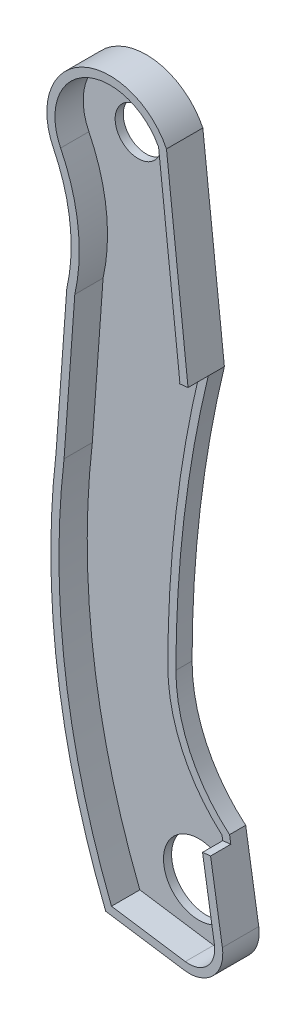
ISO-10303-21;
HEADER;
FILE_DESCRIPTION(('STEP AP214'),'2;1');
FILE_NAME('part.step','',(''),(''),'','','');
FILE_SCHEMA(('AUTOMOTIVE_DESIGN { 1 0 10303 214 1 1 1 1 }'));
ENDSEC;
DATA;
#1=APPLICATION_CONTEXT('core data for automotive mechanical design processes');
#2=APPLICATION_PROTOCOL_DEFINITION('international standard','automotive_design',2000,#1);
#3=PRODUCT_CONTEXT('',#1,'mechanical');
#4=PRODUCT('Part','Part','',(#3));
#5=PRODUCT_RELATED_PRODUCT_CATEGORY('part','',(#4));
#6=PRODUCT_DEFINITION_FORMATION('','',#4);
#7=PRODUCT_DEFINITION_CONTEXT('part definition',#1,'design');
#8=PRODUCT_DEFINITION('design','',#6,#7);
#9=PRODUCT_DEFINITION_SHAPE('','',#8);
#10=(LENGTH_UNIT() NAMED_UNIT(*) SI_UNIT(.MILLI.,.METRE.));
#11=(NAMED_UNIT(*) PLANE_ANGLE_UNIT() SI_UNIT($,.RADIAN.));
#12=(NAMED_UNIT(*) SI_UNIT($,.STERADIAN.) SOLID_ANGLE_UNIT());
#13=UNCERTAINTY_MEASURE_WITH_UNIT(LENGTH_MEASURE(1.E-05),#10,'distance_accuracy_value','');
#14=(GEOMETRIC_REPRESENTATION_CONTEXT(3) GLOBAL_UNCERTAINTY_ASSIGNED_CONTEXT((#13)) GLOBAL_UNIT_ASSIGNED_CONTEXT((#10,
#11,#12)) REPRESENTATION_CONTEXT('',''));
#15=CARTESIAN_POINT('',(0.,0.,0.));
#16=DIRECTION('',(0.,0.,1.));
#17=DIRECTION('',(1.,0.,0.));
#18=AXIS2_PLACEMENT_3D('',#15,#16,#17);
#19=CARTESIAN_POINT('',(57.3609756659918,78.037747086541,3.429));
#20=DIRECTION('',(0.,0.,-1.));
#21=DIRECTION('',(-1.,0.,0.));
#22=AXIS2_PLACEMENT_3D('',#19,#20,#21);
#23=CYLINDRICAL_SURFACE('',#22,5.94359999999999);
#24=CARTESIAN_POINT('',(57.3609756659918,78.037747086541,0.));
#25=DIRECTION('',(0.,0.,1.));
#26=DIRECTION('',(1.,0.,0.));
#27=AXIS2_PLACEMENT_3D('',#24,#25,#26);
#28=CIRCLE('',#27,5.94359999999999);
#29=CARTESIAN_POINT('',(62.6949756659918,80.6597358279356,0.));
#30=VERTEX_POINT('',#29);
#31=CARTESIAN_POINT('',(52.0310096586241,75.4075677541942,0.));
#32=VERTEX_POINT('',#31);
#33=EDGE_CURVE('E315',#30,#32,#28,.T.);
#34=ORIENTED_EDGE('',*,*,#33,.T.);
#35=DIRECTION('',(0.,0.,-1.));
#36=VECTOR('',#35,1.);
#37=CARTESIAN_POINT('',(52.0310096586241,75.4075677541942,3.429));
#38=LINE('',#37,#36);
#39=CARTESIAN_POINT('',(52.0310096586241,75.4075677541942,3.429));
#40=VERTEX_POINT('',#39);
#41=EDGE_CURVE('E254',#40,#32,#38,.T.);
#42=ORIENTED_EDGE('',*,*,#41,.F.);
#43=CARTESIAN_POINT('',(57.3609756659918,78.037747086541,3.429));
#44=DIRECTION('',(0.,0.,1.));
#45=DIRECTION('',(1.,0.,0.));
#46=AXIS2_PLACEMENT_3D('',#43,#44,#45);
#47=CIRCLE('',#46,5.94359999999999);
#48=CARTESIAN_POINT('',(62.6949756659918,80.6597358279356,3.429));
#49=VERTEX_POINT('',#48);
#50=EDGE_CURVE('E323',#49,#40,#47,.T.);
#51=ORIENTED_EDGE('',*,*,#50,.F.);
#52=DIRECTION('',(0.,0.,-1.));
#53=VECTOR('',#52,1.);
#54=CARTESIAN_POINT('',(62.6949756659918,80.6597358279356,3.429));
#55=LINE('',#54,#53);
#56=EDGE_CURVE('E232',#49,#30,#55,.T.);
#57=ORIENTED_EDGE('',*,*,#56,.T.);
#58=EDGE_LOOP('',(#34,#42,#51,#57));
#59=FACE_BOUND('',#58,.T.);
#60=ADVANCED_FACE('F50',(#59),#23,.T.);
#61=CARTESIAN_POINT('',(37.4533248521482,68.2139148793995,3.429));
#62=DIRECTION('',(0.,0.,-1.));
#63=DIRECTION('',(-1.,0.,0.));
#64=AXIS2_PLACEMENT_3D('',#61,#62,#63);
#65=CYLINDRICAL_SURFACE('',#64,16.256);
#66=CARTESIAN_POINT('',(37.4533248521482,68.2139148793995,0.));
#67=DIRECTION('',(0.,0.,-1.));
#68=DIRECTION('',(1.,0.,0.));
#69=AXIS2_PLACEMENT_3D('',#66,#67,#68);
#70=CIRCLE('',#69,16.256);
#71=CARTESIAN_POINT('',(53.2969756659918,64.575747086541,0.));
#72=VERTEX_POINT('',#71);
#73=EDGE_CURVE('E342',#32,#72,#70,.T.);
#74=ORIENTED_EDGE('',*,*,#73,.T.);
#75=DIRECTION('',(0.,0.,-1.));
#76=VECTOR('',#75,1.);
#77=CARTESIAN_POINT('',(53.2969756659918,64.575747086541,3.429));
#78=LINE('',#77,#76);
#79=CARTESIAN_POINT('',(53.2969756659918,64.575747086541,3.429));
#80=VERTEX_POINT('',#79);
#81=EDGE_CURVE('E251',#80,#72,#78,.T.);
#82=ORIENTED_EDGE('',*,*,#81,.F.);
#83=CARTESIAN_POINT('',(37.4533248521482,68.2139148793995,3.429));
#84=DIRECTION('',(0.,0.,-1.));
#85=DIRECTION('',(1.,0.,0.));
#86=AXIS2_PLACEMENT_3D('',#83,#84,#85);
#87=CIRCLE('',#86,16.256);
#88=EDGE_CURVE('E326',#40,#80,#87,.T.);
#89=ORIENTED_EDGE('',*,*,#88,.F.);
#90=ORIENTED_EDGE('',*,*,#41,.T.);
#91=EDGE_LOOP('',(#74,#82,#89,#90));
#92=FACE_BOUND('',#91,.T.);
#93=ADVANCED_FACE('F369',(#92),#65,.F.);
#94=CARTESIAN_POINT('',(53.2969756659918,64.575747086541,3.429));
#95=DIRECTION('',(0.997365816958794,-0.0725356957788216,0.));
#96=DIRECTION('',(0.0725356957788216,0.997365816958794,0.));
#97=AXIS2_PLACEMENT_3D('',#94,#95,#96);
#98=PLANE('',#97);
#99=DIRECTION('',(-0.0725356957788216,-0.997365816958794,0.));
#100=VECTOR('',#99,1.);
#101=CARTESIAN_POINT('',(53.2969756659918,64.575747086541,0.));
#102=LINE('',#101,#100);
#103=CARTESIAN_POINT('',(52.2809756659918,50.605747086541,0.));
#104=VERTEX_POINT('',#103);
#105=EDGE_CURVE('E344',#72,#104,#102,.T.);
#106=ORIENTED_EDGE('',*,*,#105,.T.);
#107=DIRECTION('',(0.,0.,-1.));
#108=VECTOR('',#107,1.);
#109=CARTESIAN_POINT('',(52.2809756659918,50.605747086541,3.429));
#110=LINE('',#109,#108);
#111=CARTESIAN_POINT('',(52.2809756659918,50.605747086541,3.429));
#112=VERTEX_POINT('',#111);
#113=EDGE_CURVE('E248',#112,#104,#110,.T.);
#114=ORIENTED_EDGE('',*,*,#113,.F.);
#115=DIRECTION('',(-0.0725356957788216,-0.997365816958794,0.));
#116=VECTOR('',#115,1.);
#117=CARTESIAN_POINT('',(53.2969756659918,64.575747086541,3.429));
#118=LINE('',#117,#116);
#119=EDGE_CURVE('E329',#80,#112,#118,.T.);
#120=ORIENTED_EDGE('',*,*,#119,.F.);
#121=ORIENTED_EDGE('',*,*,#81,.T.);
#122=EDGE_LOOP('',(#106,#114,#120,#121));
#123=FACE_BOUND('',#122,.T.);
#124=ADVANCED_FACE('F470',(#123),#98,.F.);
#125=CARTESIAN_POINT('',(123.423432401689,42.2798096852975,3.429));
#126=DIRECTION('',(0.,0.,-1.));
#127=DIRECTION('',(-1.,0.,0.));
#128=AXIS2_PLACEMENT_3D('',#125,#126,#127);
#129=CYLINDRICAL_SURFACE('',#128,71.628);
#130=CARTESIAN_POINT('',(123.423432401689,42.2798096852975,0.));
#131=DIRECTION('',(0.,0.,1.));
#132=DIRECTION('',(1.,0.,0.));
#133=AXIS2_PLACEMENT_3D('',#130,#131,#132);
#134=CIRCLE('',#133,71.628);
#135=CARTESIAN_POINT('',(56.9682748744713,15.553747086541,0.));
#136=VERTEX_POINT('',#135);
#137=EDGE_CURVE('E346',#104,#136,#134,.T.);
#138=ORIENTED_EDGE('',*,*,#137,.T.);
#139=DIRECTION('',(0.,0.,-1.));
#140=VECTOR('',#139,1.);
#141=CARTESIAN_POINT('',(56.9682748744713,15.553747086541,3.429));
#142=LINE('',#141,#140);
#143=CARTESIAN_POINT('',(56.9682748744713,15.553747086541,3.429));
#144=VERTEX_POINT('',#143);
#145=EDGE_CURVE('E245',#144,#136,#142,.T.);
#146=ORIENTED_EDGE('',*,*,#145,.F.);
#147=CARTESIAN_POINT('',(123.423432401689,42.2798096852975,3.429));
#148=DIRECTION('',(0.,0.,1.));
#149=DIRECTION('',(1.,0.,0.));
#150=AXIS2_PLACEMENT_3D('',#147,#148,#149);
#151=CIRCLE('',#150,71.628);
#152=EDGE_CURVE('E331',#112,#144,#151,.T.);
#153=ORIENTED_EDGE('',*,*,#152,.F.);
#154=ORIENTED_EDGE('',*,*,#113,.T.);
#155=EDGE_LOOP('',(#138,#146,#153,#154));
#156=FACE_BOUND('',#155,.T.);
#157=ADVANCED_FACE('F468',(#156),#129,.T.);
#158=CARTESIAN_POINT('',(56.9682748744713,15.553747086541,3.429));
#159=DIRECTION('',(0.147671249242656,0.989036501928576,0.));
#160=DIRECTION('',(-0.989036501928576,0.147671249242656,0.));
#161=AXIS2_PLACEMENT_3D('',#158,#159,#160);
#162=PLANE('',#161);
#163=DIRECTION('',(0.989036501928576,-0.147671249242656,0.));
#164=VECTOR('',#163,1.);
#165=CARTESIAN_POINT('',(56.9682748744713,15.553747086541,0.));
#166=LINE('',#165,#164);
#167=CARTESIAN_POINT('',(64.3609255195925,14.4499638046795,0.));
#168=VERTEX_POINT('',#167);
#169=EDGE_CURVE('E348',#136,#168,#166,.T.);
#170=ORIENTED_EDGE('',*,*,#169,.T.);
#171=DIRECTION('',(0.,0.,-1.));
#172=VECTOR('',#171,1.);
#173=CARTESIAN_POINT('',(64.3609255195925,14.4499638046795,3.429));
#174=LINE('',#173,#172);
#175=CARTESIAN_POINT('',(64.3609255195925,14.4499638046795,3.429));
#176=VERTEX_POINT('',#175);
#177=EDGE_CURVE('E262',#168,#176,#174,.F.);
#178=ORIENTED_EDGE('',*,*,#177,.T.);
#179=DIRECTION('',(0.989036501928576,-0.147671249242656,0.));
#180=VECTOR('',#179,1.);
#181=CARTESIAN_POINT('',(56.9682748744713,15.553747086541,3.429));
#182=LINE('',#181,#180);
#183=EDGE_CURVE('E333',#144,#176,#182,.T.);
#184=ORIENTED_EDGE('',*,*,#183,.F.);
#185=ORIENTED_EDGE('',*,*,#145,.T.);
#186=EDGE_LOOP('',(#170,#178,#184,#185));
#187=FACE_BOUND('',#186,.T.);
#188=ADVANCED_FACE('F461',(#187),#162,.F.);
#189=CARTESIAN_POINT('',(66.736169072151,25.7472302029005,3.429));
#190=DIRECTION('',(-0.987362762055992,-0.158476421290872,0.));
#191=DIRECTION('',(0.158476421290872,-0.987362762055992,0.));
#192=AXIS2_PLACEMENT_3D('',#189,#190,#191);
#193=PLANE('',#192);
#194=DIRECTION('',(0.,0.,-1.));
#195=VECTOR('',#194,1.);
#196=CARTESIAN_POINT('',(66.736169072151,25.7472302029005,3.429));
#197=LINE('',#196,#195);
#198=CARTESIAN_POINT('',(66.736169072151,25.7472302029005,1.524));
#199=VERTEX_POINT('',#198);
#200=CARTESIAN_POINT('',(66.736169072151,25.7472302029005,0.));
#201=VERTEX_POINT('',#200);
#202=EDGE_CURVE('E239',#199,#201,#197,.T.);
#203=ORIENTED_EDGE('',*,*,#202,.F.);
#204=DIRECTION('',(0.158476421290872,-0.987362762055992,0.));
#205=VECTOR('',#204,1.);
#206=CARTESIAN_POINT('',(66.736169072151,25.7472302029005,1.52399999999999));
#207=LINE('',#206,#205);
#208=CARTESIAN_POINT('',(66.8532383494613,25.0178482288794,1.52399999999999));
#209=VERTEX_POINT('',#208);
#210=EDGE_CURVE('E383',#199,#209,#207,.T.);
#211=ORIENTED_EDGE('',*,*,#210,.T.);
#212=DIRECTION('',(0.,0.,1.));
#213=VECTOR('',#212,1.);
#214=CARTESIAN_POINT('',(66.8532383494613,25.0178482288794,3.429));
#215=LINE('',#214,#213);
#216=CARTESIAN_POINT('',(66.8532383494613,25.0178482288794,3.429));
#217=VERTEX_POINT('',#216);
#218=EDGE_CURVE('E386',#209,#217,#215,.T.);
#219=ORIENTED_EDGE('',*,*,#218,.T.);
#220=DIRECTION('',(-0.158476421290872,0.987362762055992,0.));
#221=VECTOR('',#220,1.);
#222=CARTESIAN_POINT('',(66.736169072151,25.7472302029005,3.429));
#223=LINE('',#222,#221);
#224=CARTESIAN_POINT('',(67.9646585054657,18.0933173359012,3.429));
#225=VERTEX_POINT('',#224);
#226=EDGE_CURVE('E336',#225,#217,#223,.T.);
#227=ORIENTED_EDGE('',*,*,#226,.F.);
#228=DIRECTION('',(0.,0.,-1.));
#229=VECTOR('',#228,1.);
#230=CARTESIAN_POINT('',(67.9646585054657,18.0933173359012,3.429));
#231=LINE('',#230,#229);
#232=CARTESIAN_POINT('',(67.9646585054657,18.0933173359012,0.));
#233=VERTEX_POINT('',#232);
#234=EDGE_CURVE('E257',#225,#233,#231,.T.);
#235=ORIENTED_EDGE('',*,*,#234,.T.);
#236=DIRECTION('',(-0.158476421290872,0.987362762055992,0.));
#237=VECTOR('',#236,1.);
#238=CARTESIAN_POINT('',(66.736169072151,25.7472302029005,0.));
#239=LINE('',#238,#237);
#240=EDGE_CURVE('E351',#233,#201,#239,.T.);
#241=ORIENTED_EDGE('',*,*,#240,.T.);
#242=EDGE_LOOP('',(#203,#211,#219,#227,#235,#241));
#243=FACE_BOUND('',#242,.T.);
#244=ADVANCED_FACE('F451',(#243),#193,.F.);
#245=CARTESIAN_POINT('',(75.9029703413764,36.6234395834948,3.429));
#246=DIRECTION('',(0.,0.,-1.));
#247=DIRECTION('',(-1.,0.,0.));
#248=AXIS2_PLACEMENT_3D('',#245,#246,#247);
#249=CYLINDRICAL_SURFACE('',#248,14.224);
#250=DIRECTION('',(0.,0.,-1.));
#251=VECTOR('',#250,1.);
#252=CARTESIAN_POINT('',(61.6789756659918,36.6357470865411,3.429));
#253=LINE('',#252,#251);
#254=CARTESIAN_POINT('',(61.6789756659918,36.6357470865411,1.524));
#255=VERTEX_POINT('',#254);
#256=CARTESIAN_POINT('',(61.6789756659918,36.6357470865411,0.));
#257=VERTEX_POINT('',#256);
#258=EDGE_CURVE('E238',#255,#257,#253,.T.);
#259=ORIENTED_EDGE('',*,*,#258,.F.);
#260=CARTESIAN_POINT('',(75.9029703413764,36.6234395834948,1.524));
#261=DIRECTION('',(0.,0.,-1.));
#262=DIRECTION('',(0.,1.,0.));
#263=AXIS2_PLACEMENT_3D('',#260,#261,#262);
#264=CIRCLE('',#263,14.224);
#265=EDGE_CURVE('E209',#255,#199,#264,.F.);
#266=ORIENTED_EDGE('',*,*,#265,.T.);
#267=ORIENTED_EDGE('',*,*,#202,.T.);
#268=CARTESIAN_POINT('',(75.9029703413764,36.6234395834948,0.));
#269=DIRECTION('',(0.,0.,-1.));
#270=DIRECTION('',(1.,0.,0.));
#271=AXIS2_PLACEMENT_3D('',#268,#269,#270);
#272=CIRCLE('',#271,14.224);
#273=EDGE_CURVE('E354',#201,#257,#272,.T.);
#274=ORIENTED_EDGE('',*,*,#273,.T.);
#275=EDGE_LOOP('',(#259,#266,#267,#274));
#276=FACE_BOUND('',#275,.T.);
#277=ADVANCED_FACE('F455',(#276),#249,.F.);
#278=CARTESIAN_POINT('',(171.15293468547,36.5410232684532,3.429));
#279=DIRECTION('',(0.,0.,-1.));
#280=DIRECTION('',(-1.,0.,0.));
#281=AXIS2_PLACEMENT_3D('',#278,#279,#280);
#282=CYLINDRICAL_SURFACE('',#281,109.474);
#283=DIRECTION('',(0.,0.,-1.));
#284=VECTOR('',#283,1.);
#285=CARTESIAN_POINT('',(64.7269756659918,62.1939358279356,3.429));
#286=LINE('',#285,#284);
#287=CARTESIAN_POINT('',(64.7269756659918,62.1939358279356,1.524));
#288=VERTEX_POINT('',#287);
#289=CARTESIAN_POINT('',(64.7269756659918,62.1939358279356,0.));
#290=VERTEX_POINT('',#289);
#291=EDGE_CURVE('E226',#288,#290,#286,.T.);
#292=ORIENTED_EDGE('',*,*,#291,.F.);
#293=CARTESIAN_POINT('',(171.15293468547,36.5410232684532,1.52399999999999));
#294=DIRECTION('',(0.,0.,-1.));
#295=DIRECTION('',(0.,1.,0.));
#296=AXIS2_PLACEMENT_3D('',#293,#294,#295);
#297=CIRCLE('',#296,109.474);
#298=EDGE_CURVE('E206',#288,#255,#297,.F.);
#299=ORIENTED_EDGE('',*,*,#298,.T.);
#300=ORIENTED_EDGE('',*,*,#258,.T.);
#301=CARTESIAN_POINT('',(171.15293468547,36.5410232684532,0.));
#302=DIRECTION('',(0.,0.,-1.));
#303=DIRECTION('',(1.,0.,0.));
#304=AXIS2_PLACEMENT_3D('',#301,#302,#303);
#305=CIRCLE('',#304,109.474);
#306=EDGE_CURVE('E229',#257,#290,#305,.T.);
#307=ORIENTED_EDGE('',*,*,#306,.T.);
#308=EDGE_LOOP('',(#292,#299,#300,#307));
#309=FACE_BOUND('',#308,.T.);
#310=ADVANCED_FACE('F227',(#309),#282,.F.);
#311=CARTESIAN_POINT('',(62.6949756659918,80.6597358279356,3.429));
#312=DIRECTION('',(-0.993999897084816,-0.109381006556788,0.));
#313=DIRECTION('',(0.109381006556788,-0.993999897084816,0.));
#314=AXIS2_PLACEMENT_3D('',#311,#312,#313);
#315=PLANE('',#314);
#316=DIRECTION('',(-0.109381006556788,0.993999897084816,0.));
#317=VECTOR('',#316,1.);
#318=CARTESIAN_POINT('',(62.6949756659918,80.6597358279356,0.));
#319=LINE('',#318,#317);
#320=EDGE_CURVE('E327',#290,#30,#319,.T.);
#321=ORIENTED_EDGE('',*,*,#320,.T.);
#322=ORIENTED_EDGE('',*,*,#56,.F.);
#323=DIRECTION('',(-0.109381006556788,0.993999897084816,0.));
#324=VECTOR('',#323,1.);
#325=CARTESIAN_POINT('',(62.6949756659918,80.6597358279356,3.429));
#326=LINE('',#325,#324);
#327=CARTESIAN_POINT('',(64.7269756659918,62.1939358279356,3.429));
#328=VERTEX_POINT('',#327);
#329=EDGE_CURVE('E237',#328,#49,#326,.T.);
#330=ORIENTED_EDGE('',*,*,#329,.F.);
#331=EDGE_CURVE('E218',#328,#288,#286,.T.);
#332=ORIENTED_EDGE('',*,*,#331,.T.);
#333=ORIENTED_EDGE('',*,*,#291,.T.);
#334=EDGE_LOOP('',(#321,#322,#330,#332,#333));
#335=FACE_BOUND('',#334,.T.);
#336=ADVANCED_FACE('F235',(#335),#315,.F.);
#337=CARTESIAN_POINT('',(57.3609756659918,78.037747086541,3.429));
#338=DIRECTION('',(0.,0.,1.));
#339=DIRECTION('',(1.,0.,0.));
#340=AXIS2_PLACEMENT_3D('',#337,#338,#339);
#341=PLANE('',#340);
#342=DIRECTION('',(0.993999897084815,0.109381006556788,0.));
#343=VECTOR('',#342,1.);
#344=CARTESIAN_POINT('',(56.2690305416971,61.2632128431439,3.429));
#345=LINE('',#344,#343);
#346=CARTESIAN_POINT('',(63.9221567218253,62.1053725328416,3.429));
#347=VERTEX_POINT('',#346);
#348=EDGE_CURVE('E222',#347,#328,#345,.T.);
#349=ORIENTED_EDGE('',*,*,#348,.T.);
#350=ORIENTED_EDGE('',*,*,#329,.T.);
#351=ORIENTED_EDGE('',*,*,#50,.T.);
#352=ORIENTED_EDGE('',*,*,#88,.T.);
#353=ORIENTED_EDGE('',*,*,#119,.T.);
#354=ORIENTED_EDGE('',*,*,#152,.T.);
#355=ORIENTED_EDGE('',*,*,#183,.T.);
#356=CARTESIAN_POINT('',(64.829781735938,17.5901546983027,3.429));
#357=DIRECTION('',(0.,0.,1.));
#358=DIRECTION('',(1.,0.,0.));
#359=AXIS2_PLACEMENT_3D('',#356,#357,#358);
#360=CIRCLE('',#359,3.175);
#361=EDGE_CURVE('E264',#176,#225,#360,.T.);
#362=ORIENTED_EDGE('',*,*,#361,.T.);
#363=ORIENTED_EDGE('',*,*,#226,.T.);
#364=DIRECTION('',(0.993999897084815,0.109381006556788,0.));
#365=VECTOR('',#364,1.);
#366=CARTESIAN_POINT('',(60.3364288991152,24.3007302701068,3.429));
#367=LINE('',#366,#365);
#368=CARTESIAN_POINT('',(66.0948797659407,24.9343974906653,3.429));
#369=VERTEX_POINT('',#368);
#370=EDGE_CURVE('E379',#369,#217,#367,.T.);
#371=ORIENTED_EDGE('',*,*,#370,.F.);
#372=DIRECTION('',(-0.158476421290872,0.987362762055992,0.));
#373=VECTOR('',#372,1.);
#374=CARTESIAN_POINT('',(65.9837986474644,25.6264711698768,3.429));
#375=LINE('',#374,#373);
#376=CARTESIAN_POINT('',(67.2122880807791,17.9725583028776,3.429));
#377=VERTEX_POINT('',#376);
#378=EDGE_CURVE('E312',#377,#369,#375,.T.);
#379=ORIENTED_EDGE('',*,*,#378,.F.);
#380=CARTESIAN_POINT('',(64.829781735938,17.5901546983027,3.429));
#381=DIRECTION('',(0.,0.,1.));
#382=DIRECTION('',(1.,0.,0.));
#383=AXIS2_PLACEMENT_3D('',#380,#381,#382);
#384=CIRCLE('',#383,2.413);
#385=CARTESIAN_POINT('',(64.4734510115154,15.2036096191491,3.429));
#386=VERTEX_POINT('',#385);
#387=EDGE_CURVE('E313',#386,#377,#384,.T.);
#388=ORIENTED_EDGE('',*,*,#387,.F.);
#389=DIRECTION('',(0.989036501928576,-0.147671249242656,0.));
#390=VECTOR('',#389,1.);
#391=CARTESIAN_POINT('',(57.0808003663942,16.3073929010106,3.429));
#392=LINE('',#391,#390);
#393=CARTESIAN_POINT('',(57.513949579399,16.2427201763254,3.429));
#394=VERTEX_POINT('',#393);
#395=EDGE_CURVE('E309',#394,#386,#392,.T.);
#396=ORIENTED_EDGE('',*,*,#395,.F.);
#397=CARTESIAN_POINT('',(123.423432401689,42.2798096852975,3.429));
#398=DIRECTION('',(0.,0.,1.));
#399=DIRECTION('',(1.,0.,0.));
#400=AXIS2_PLACEMENT_3D('',#397,#398,#399);
#401=CIRCLE('',#400,70.866);
#402=CARTESIAN_POINT('',(53.0397516836617,50.5337447821322,3.429));
#403=VERTEX_POINT('',#402);
#404=EDGE_CURVE('E307',#403,#394,#401,.T.);
#405=ORIENTED_EDGE('',*,*,#404,.F.);
#406=DIRECTION('',(-0.0725356957788216,-0.997365816958794,0.));
#407=VECTOR('',#406,1.);
#408=CARTESIAN_POINT('',(54.0569684185144,64.5204748863576,3.429));
#409=LINE('',#408,#407);
#410=CARTESIAN_POINT('',(54.0527774108343,64.4628485307552,3.429));
#411=VERTEX_POINT('',#410);
#412=EDGE_CURVE('E305',#411,#403,#409,.T.);
#413=ORIENTED_EDGE('',*,*,#412,.F.);
#414=CARTESIAN_POINT('',(37.4533248521482,68.2139148793995,3.429));
#415=DIRECTION('',(0.,0.,1.));
#416=DIRECTION('',(1.,0.,0.));
#417=AXIS2_PLACEMENT_3D('',#414,#415,#416);
#418=CIRCLE('',#417,17.018);
#419=CARTESIAN_POINT('',(52.7143386339277,75.7447702327002,3.429));
#420=VERTEX_POINT('',#419);
#421=EDGE_CURVE('E302',#420,#411,#418,.F.);
#422=ORIENTED_EDGE('',*,*,#421,.F.);
#423=CARTESIAN_POINT('',(57.3609756659918,78.037747086541,3.429));
#424=DIRECTION('',(0.,0.,1.));
#425=DIRECTION('',(1.,0.,0.));
#426=AXIS2_PLACEMENT_3D('',#423,#424,#425);
#427=CIRCLE('',#426,5.1816);
#428=CARTESIAN_POINT('',(61.95268511946,80.4388266052015,3.429));
#429=VERTEX_POINT('',#428);
#430=EDGE_CURVE('E300',#429,#420,#427,.T.);
#431=ORIENTED_EDGE('',*,*,#430,.F.);
#432=DIRECTION('',(-0.109381006556788,0.993999897084816,0.));
#433=VECTOR('',#432,1.);
#434=CARTESIAN_POINT('',(61.9375477444132,80.5763875009393,3.429));
#435=LINE('',#434,#433);
#436=CARTESIAN_POINT('',(63.9550034108025,62.2427591326269,3.429));
#437=VERTEX_POINT('',#436);
#438=EDGE_CURVE('E321',#437,#429,#435,.T.);
#439=ORIENTED_EDGE('',*,*,#438,.F.);
#440=CARTESIAN_POINT('',(171.15293468547,36.5410232684532,3.429));
#441=DIRECTION('',(0.,0.,1.));
#442=DIRECTION('',(1.,0.,0.));
#443=AXIS2_PLACEMENT_3D('',#440,#441,#442);
#444=CIRCLE('',#443,110.236);
#445=EDGE_CURVE('E319',#347,#437,#444,.F.);
#446=ORIENTED_EDGE('',*,*,#445,.F.);
#447=EDGE_LOOP('',(#349,#350,#351,#352,#353,#354,#355,#362,#363,#371,#379,#388,#396,#405,#413,
#422,#431,#439,#446));
#448=FACE_BOUND('',#447,.T.);
#449=ADVANCED_FACE('F372',(#448),#341,.T.);
#450=CARTESIAN_POINT('',(57.3609756659918,78.037747086541,0.));
#451=DIRECTION('',(0.,0.,1.));
#452=DIRECTION('',(1.,0.,0.));
#453=AXIS2_PLACEMENT_3D('',#450,#451,#452);
#454=PLANE('',#453);
#455=CARTESIAN_POINT('',(57.3609756659918,78.037747086541,0.));
#456=DIRECTION('',(0.,0.,1.));
#457=DIRECTION('',(1.,0.,0.));
#458=AXIS2_PLACEMENT_3D('',#455,#456,#457);
#459=CIRCLE('',#458,2.1717);
#460=CARTESIAN_POINT('',(59.5326756659918,78.037747086541,0.));
#461=VERTEX_POINT('',#460);
#462=EDGE_CURVE('E271',#461,#461,#459,.T.);
#463=ORIENTED_EDGE('',*,*,#462,.T.);
#464=EDGE_LOOP('',(#463));
#465=FACE_BOUND('',#464,.T.);
#466=CARTESIAN_POINT('',(63.0728841840475,19.8813171092555,0.));
#467=DIRECTION('',(0.,0.,1.));
#468=DIRECTION('',(1.,0.,0.));
#469=AXIS2_PLACEMENT_3D('',#466,#467,#468);
#470=CIRCLE('',#469,3.3274);
#471=CARTESIAN_POINT('',(66.4002841840475,19.8813171092555,0.));
#472=VERTEX_POINT('',#471);
#473=EDGE_CURVE('E389',#472,#472,#470,.T.);
#474=ORIENTED_EDGE('',*,*,#473,.T.);
#475=EDGE_LOOP('',(#474));
#476=FACE_BOUND('',#475,.T.);
#477=ORIENTED_EDGE('',*,*,#240,.F.);
#478=CARTESIAN_POINT('',(64.829781735938,17.5901546983027,0.));
#479=DIRECTION('',(0.,0.,1.));
#480=DIRECTION('',(1.,0.,0.));
#481=AXIS2_PLACEMENT_3D('',#478,#479,#480);
#482=CIRCLE('',#481,3.175);
#483=EDGE_CURVE('E260',#233,#168,#482,.F.);
#484=ORIENTED_EDGE('',*,*,#483,.T.);
#485=ORIENTED_EDGE('',*,*,#169,.F.);
#486=ORIENTED_EDGE('',*,*,#137,.F.);
#487=ORIENTED_EDGE('',*,*,#105,.F.);
#488=ORIENTED_EDGE('',*,*,#73,.F.);
#489=ORIENTED_EDGE('',*,*,#33,.F.);
#490=ORIENTED_EDGE('',*,*,#320,.F.);
#491=ORIENTED_EDGE('',*,*,#306,.F.);
#492=ORIENTED_EDGE('',*,*,#273,.F.);
#493=EDGE_LOOP('',(#477,#484,#485,#486,#487,#488,#489,#490,#491,#492));
#494=FACE_BOUND('',#493,.T.);
#495=ADVANCED_FACE('F364',(#465,#476,#494),#454,.F.);
#496=CARTESIAN_POINT('',(64.829781735938,17.5901546983027,3.429));
#497=DIRECTION('',(0.,0.,-1.));
#498=DIRECTION('',(-1.,0.,0.));
#499=AXIS2_PLACEMENT_3D('',#496,#497,#498);
#500=CYLINDRICAL_SURFACE('',#499,3.175);
#501=ORIENTED_EDGE('',*,*,#361,.F.);
#502=ORIENTED_EDGE('',*,*,#177,.F.);
#503=ORIENTED_EDGE('',*,*,#483,.F.);
#504=ORIENTED_EDGE('',*,*,#234,.F.);
#505=EDGE_LOOP('',(#501,#502,#503,#504));
#506=FACE_BOUND('',#505,.T.);
#507=ADVANCED_FACE('F52',(#506),#500,.T.);
#508=CARTESIAN_POINT('',(57.3609756659918,78.037747086541,3.429));
#509=DIRECTION('',(0.,0.,-1.));
#510=DIRECTION('',(-1.,0.,0.));
#511=AXIS2_PLACEMENT_3D('',#508,#509,#510);
#512=CYLINDRICAL_SURFACE('',#511,5.1816);
#513=CARTESIAN_POINT('',(57.3609756659918,78.037747086541,0.762));
#514=DIRECTION('',(0.,0.,1.));
#515=DIRECTION('',(1.,0.,0.));
#516=AXIS2_PLACEMENT_3D('',#513,#514,#515);
#517=CIRCLE('',#516,5.1816);
#518=CARTESIAN_POINT('',(61.95268511946,80.4388266052015,0.762));
#519=VERTEX_POINT('',#518);
#520=CARTESIAN_POINT('',(52.7143386339277,75.7447702327002,0.762));
#521=VERTEX_POINT('',#520);
#522=EDGE_CURVE('E274',#519,#521,#517,.T.);
#523=ORIENTED_EDGE('',*,*,#522,.F.);
#524=DIRECTION('',(0.,0.,-1.));
#525=VECTOR('',#524,1.);
#526=CARTESIAN_POINT('',(61.95268511946,80.4388266052015,3.429));
#527=LINE('',#526,#525);
#528=EDGE_CURVE('E296',#429,#519,#527,.T.);
#529=ORIENTED_EDGE('',*,*,#528,.F.);
#530=ORIENTED_EDGE('',*,*,#430,.T.);
#531=DIRECTION('',(0.,0.,-1.));
#532=VECTOR('',#531,1.);
#533=CARTESIAN_POINT('',(52.7143386339277,75.7447702327002,3.429));
#534=LINE('',#533,#532);
#535=EDGE_CURVE('E397',#420,#521,#534,.T.);
#536=ORIENTED_EDGE('',*,*,#535,.T.);
#537=EDGE_LOOP('',(#523,#529,#530,#536));
#538=FACE_BOUND('',#537,.T.);
#539=ADVANCED_FACE('F515',(#538),#512,.F.);
#540=CARTESIAN_POINT('',(37.4533248521482,68.2139148793995,3.429));
#541=DIRECTION('',(0.,0.,-1.));
#542=DIRECTION('',(-1.,0.,0.));
#543=AXIS2_PLACEMENT_3D('',#540,#541,#542);
#544=CYLINDRICAL_SURFACE('',#543,17.018);
#545=CARTESIAN_POINT('',(37.4533248521482,68.2139148793995,0.762));
#546=DIRECTION('',(0.,0.,1.));
#547=DIRECTION('',(1.,0.,0.));
#548=AXIS2_PLACEMENT_3D('',#545,#546,#547);
#549=CIRCLE('',#548,17.018);
#550=CARTESIAN_POINT('',(54.0527774108343,64.4628485307552,0.762));
#551=VERTEX_POINT('',#550);
#552=EDGE_CURVE('E396',#521,#551,#549,.F.);
#553=ORIENTED_EDGE('',*,*,#552,.F.);
#554=ORIENTED_EDGE('',*,*,#535,.F.);
#555=ORIENTED_EDGE('',*,*,#421,.T.);
#556=DIRECTION('',(0.,0.,-1.));
#557=VECTOR('',#556,1.);
#558=CARTESIAN_POINT('',(54.0527774108343,64.4628485307552,3.429));
#559=LINE('',#558,#557);
#560=EDGE_CURVE('E401',#411,#551,#559,.T.);
#561=ORIENTED_EDGE('',*,*,#560,.T.);
#562=EDGE_LOOP('',(#553,#554,#555,#561));
#563=FACE_BOUND('',#562,.T.);
#564=ADVANCED_FACE('F525',(#563),#544,.T.);
#565=CARTESIAN_POINT('',(54.0569684185144,64.5204748863576,3.429));
#566=DIRECTION('',(0.997365816958794,-0.0725356957788216,0.));
#567=DIRECTION('',(0.0725356957788216,0.997365816958794,0.));
#568=AXIS2_PLACEMENT_3D('',#565,#566,#567);
#569=PLANE('',#568);
#570=DIRECTION('',(-0.0725356957788216,-0.997365816958794,0.));
#571=VECTOR('',#570,1.);
#572=CARTESIAN_POINT('',(54.0569684185144,64.5204748863576,0.762));
#573=LINE('',#572,#571);
#574=CARTESIAN_POINT('',(53.0397516836617,50.5337447821322,0.762));
#575=VERTEX_POINT('',#574);
#576=EDGE_CURVE('E405',#551,#575,#573,.T.);
#577=ORIENTED_EDGE('',*,*,#576,.F.);
#578=ORIENTED_EDGE('',*,*,#560,.F.);
#579=ORIENTED_EDGE('',*,*,#412,.T.);
#580=DIRECTION('',(0.,0.,-1.));
#581=VECTOR('',#580,1.);
#582=CARTESIAN_POINT('',(53.0397516836617,50.5337447821322,3.429));
#583=LINE('',#582,#581);
#584=EDGE_CURVE('E73',#403,#575,#583,.T.);
#585=ORIENTED_EDGE('',*,*,#584,.T.);
#586=EDGE_LOOP('',(#577,#578,#579,#585));
#587=FACE_BOUND('',#586,.T.);
#588=ADVANCED_FACE('F535',(#587),#569,.T.);
#589=CARTESIAN_POINT('',(123.423432401689,42.2798096852975,3.429));
#590=DIRECTION('',(0.,0.,-1.));
#591=DIRECTION('',(-1.,0.,0.));
#592=AXIS2_PLACEMENT_3D('',#589,#590,#591);
#593=CYLINDRICAL_SURFACE('',#592,70.866);
#594=CARTESIAN_POINT('',(123.423432401689,42.2798096852975,0.762));
#595=DIRECTION('',(0.,0.,1.));
#596=DIRECTION('',(1.,0.,0.));
#597=AXIS2_PLACEMENT_3D('',#594,#595,#596);
#598=CIRCLE('',#597,70.866);
#599=CARTESIAN_POINT('',(57.513949579399,16.2427201763254,0.762));
#600=VERTEX_POINT('',#599);
#601=EDGE_CURVE('E409',#575,#600,#598,.T.);
#602=ORIENTED_EDGE('',*,*,#601,.F.);
#603=ORIENTED_EDGE('',*,*,#584,.F.);
#604=ORIENTED_EDGE('',*,*,#404,.T.);
#605=DIRECTION('',(0.,0.,-1.));
#606=VECTOR('',#605,1.);
#607=CARTESIAN_POINT('',(57.513949579399,16.2427201763254,3.429));
#608=LINE('',#607,#606);
#609=EDGE_CURVE('E294',#394,#600,#608,.T.);
#610=ORIENTED_EDGE('',*,*,#609,.T.);
#611=EDGE_LOOP('',(#602,#603,#604,#610));
#612=FACE_BOUND('',#611,.T.);
#613=ADVANCED_FACE('F545',(#612),#593,.F.);
#614=CARTESIAN_POINT('',(57.0808003663942,16.3073929010106,3.429));
#615=DIRECTION('',(0.147671249242656,0.989036501928576,0.));
#616=DIRECTION('',(-0.989036501928576,0.147671249242656,0.));
#617=AXIS2_PLACEMENT_3D('',#614,#615,#616);
#618=PLANE('',#617);
#619=DIRECTION('',(0.989036501928576,-0.147671249242656,0.));
#620=VECTOR('',#619,1.);
#621=CARTESIAN_POINT('',(57.0808003663942,16.3073929010106,0.762));
#622=LINE('',#621,#620);
#623=CARTESIAN_POINT('',(64.4734510115154,15.2036096191491,0.762));
#624=VERTEX_POINT('',#623);
#625=EDGE_CURVE('E412',#600,#624,#622,.T.);
#626=ORIENTED_EDGE('',*,*,#625,.F.);
#627=ORIENTED_EDGE('',*,*,#609,.F.);
#628=ORIENTED_EDGE('',*,*,#395,.T.);
#629=DIRECTION('',(0.,0.,1.));
#630=VECTOR('',#629,1.);
#631=CARTESIAN_POINT('',(64.4734510115154,15.2036096191491,3.429));
#632=LINE('',#631,#630);
#633=EDGE_CURVE('E316',#624,#386,#632,.T.);
#634=ORIENTED_EDGE('',*,*,#633,.F.);
#635=EDGE_LOOP('',(#626,#627,#628,#634));
#636=FACE_BOUND('',#635,.T.);
#637=ADVANCED_FACE('F441',(#636),#618,.T.);
#638=CARTESIAN_POINT('',(65.9837986474644,25.6264711698768,3.429));
#639=DIRECTION('',(-0.987362762055992,-0.158476421290872,0.));
#640=DIRECTION('',(0.158476421290872,-0.987362762055992,0.));
#641=AXIS2_PLACEMENT_3D('',#638,#639,#640);
#642=PLANE('',#641);
#643=DIRECTION('',(0.158476421290872,-0.987362762055992,0.));
#644=VECTOR('',#643,1.);
#645=CARTESIAN_POINT('',(65.9837986474644,25.6264711698768,1.52399999999999));
#646=LINE('',#645,#644);
#647=CARTESIAN_POINT('',(66.0279925439204,25.3511279527888,1.524));
#648=VERTEX_POINT('',#647);
#649=CARTESIAN_POINT('',(66.0948797659407,24.9343974906653,1.52399999999999));
#650=VERTEX_POINT('',#649);
#651=EDGE_CURVE('E213',#648,#650,#646,.T.);
#652=ORIENTED_EDGE('',*,*,#651,.F.);
#653=DIRECTION('',(0.,0.,-1.));
#654=VECTOR('',#653,1.);
#655=CARTESIAN_POINT('',(66.0279925439204,25.3511279527888,3.429));
#656=LINE('',#655,#654);
#657=CARTESIAN_POINT('',(66.0279925439204,25.3511279527888,0.762));
#658=VERTEX_POINT('',#657);
#659=EDGE_CURVE('E286',#648,#658,#656,.T.);
#660=ORIENTED_EDGE('',*,*,#659,.T.);
#661=DIRECTION('',(-0.158476421290872,0.987362762055992,0.));
#662=VECTOR('',#661,1.);
#663=CARTESIAN_POINT('',(65.9837986474644,25.6264711698768,0.762));
#664=LINE('',#663,#662);
#665=CARTESIAN_POINT('',(67.2122880807791,17.9725583028776,0.762));
#666=VERTEX_POINT('',#665);
#667=EDGE_CURVE('E417',#666,#658,#664,.T.);
#668=ORIENTED_EDGE('',*,*,#667,.F.);
#669=DIRECTION('',(0.,0.,1.));
#670=VECTOR('',#669,1.);
#671=CARTESIAN_POINT('',(67.2122880807791,17.9725583028776,3.429));
#672=LINE('',#671,#670);
#673=EDGE_CURVE('E400',#377,#666,#672,.F.);
#674=ORIENTED_EDGE('',*,*,#673,.F.);
#675=ORIENTED_EDGE('',*,*,#378,.T.);
#676=DIRECTION('',(0.,0.,1.));
#677=VECTOR('',#676,1.);
#678=CARTESIAN_POINT('',(66.0948797659407,24.9343974906653,3.429));
#679=LINE('',#678,#677);
#680=EDGE_CURVE('E13',#650,#369,#679,.T.);
#681=ORIENTED_EDGE('',*,*,#680,.F.);
#682=EDGE_LOOP('',(#652,#660,#668,#674,#675,#681));
#683=FACE_BOUND('',#682,.T.);
#684=ADVANCED_FACE('F434',(#683),#642,.T.);
#685=CARTESIAN_POINT('',(75.9029703413764,36.6234395834948,3.429));
#686=DIRECTION('',(0.,0.,-1.));
#687=DIRECTION('',(-1.,0.,0.));
#688=AXIS2_PLACEMENT_3D('',#685,#686,#687);
#689=CYLINDRICAL_SURFACE('',#688,14.986);
#690=CARTESIAN_POINT('',(75.9029703413764,36.6234395834948,1.524));
#691=DIRECTION('',(0.,0.,-1.));
#692=DIRECTION('',(0.,1.,0.));
#693=AXIS2_PLACEMENT_3D('',#690,#691,#692);
#694=CIRCLE('',#693,14.986);
#695=CARTESIAN_POINT('',(60.9169759512391,36.6364064170614,1.524));
#696=VERTEX_POINT('',#695);
#697=EDGE_CURVE('E276',#696,#648,#694,.F.);
#698=ORIENTED_EDGE('',*,*,#697,.F.);
#699=DIRECTION('',(0.,0.,-1.));
#700=VECTOR('',#699,1.);
#701=CARTESIAN_POINT('',(60.9169759512391,36.6364064170614,3.429));
#702=LINE('',#701,#700);
#703=CARTESIAN_POINT('',(60.9169759512391,36.6364064170614,0.762));
#704=VERTEX_POINT('',#703);
#705=EDGE_CURVE('E284',#696,#704,#702,.T.);
#706=ORIENTED_EDGE('',*,*,#705,.T.);
#707=CARTESIAN_POINT('',(75.9029703413764,36.6234395834948,0.762));
#708=DIRECTION('',(0.,0.,1.));
#709=DIRECTION('',(1.,0.,0.));
#710=AXIS2_PLACEMENT_3D('',#707,#708,#709);
#711=CIRCLE('',#710,14.986);
#712=EDGE_CURVE('E422',#658,#704,#711,.F.);
#713=ORIENTED_EDGE('',*,*,#712,.F.);
#714=ORIENTED_EDGE('',*,*,#659,.F.);
#715=EDGE_LOOP('',(#698,#706,#713,#714));
#716=FACE_BOUND('',#715,.T.);
#717=ADVANCED_FACE('F282',(#716),#689,.T.);
#718=CARTESIAN_POINT('',(171.15293468547,36.5410232684532,3.429));
#719=DIRECTION('',(0.,0.,-1.));
#720=DIRECTION('',(-1.,0.,0.));
#721=AXIS2_PLACEMENT_3D('',#718,#719,#720);
#722=CYLINDRICAL_SURFACE('',#721,110.236);
#723=DIRECTION('',(0.,0.,-1.));
#724=VECTOR('',#723,1.);
#725=CARTESIAN_POINT('',(63.9221567218253,62.1053725328416,3.429));
#726=LINE('',#725,#724);
#727=CARTESIAN_POINT('',(63.9221567218254,62.1053725328416,1.524));
#728=VERTEX_POINT('',#727);
#729=EDGE_CURVE('E58',#347,#728,#726,.T.);
#730=ORIENTED_EDGE('',*,*,#729,.F.);
#731=ORIENTED_EDGE('',*,*,#445,.T.);
#732=DIRECTION('',(0.,0.,-1.));
#733=VECTOR('',#732,1.);
#734=CARTESIAN_POINT('',(63.9550034108025,62.2427591326269,3.429));
#735=LINE('',#734,#733);
#736=CARTESIAN_POINT('',(63.9550034108025,62.2427591326269,0.762));
#737=VERTEX_POINT('',#736);
#738=EDGE_CURVE('E292',#437,#737,#735,.T.);
#739=ORIENTED_EDGE('',*,*,#738,.T.);
#740=CARTESIAN_POINT('',(171.15293468547,36.5410232684532,0.762));
#741=DIRECTION('',(0.,0.,1.));
#742=DIRECTION('',(1.,0.,0.));
#743=AXIS2_PLACEMENT_3D('',#740,#741,#742);
#744=CIRCLE('',#743,110.236);
#745=EDGE_CURVE('E291',#704,#737,#744,.F.);
#746=ORIENTED_EDGE('',*,*,#745,.F.);
#747=ORIENTED_EDGE('',*,*,#705,.F.);
#748=CARTESIAN_POINT('',(171.15293468547,36.5410232684532,1.52399999999999));
#749=DIRECTION('',(0.,0.,-1.));
#750=DIRECTION('',(0.,1.,0.));
#751=AXIS2_PLACEMENT_3D('',#748,#749,#750);
#752=CIRCLE('',#751,110.236);
#753=EDGE_CURVE('E266',#728,#696,#752,.F.);
#754=ORIENTED_EDGE('',*,*,#753,.F.);
#755=EDGE_LOOP('',(#730,#731,#739,#746,#747,#754));
#756=FACE_BOUND('',#755,.T.);
#757=ADVANCED_FACE('F289',(#756),#722,.T.);
#758=CARTESIAN_POINT('',(61.9375477444132,80.5763875009393,3.429));
#759=DIRECTION('',(-0.993999897084816,-0.109381006556788,0.));
#760=DIRECTION('',(0.109381006556788,-0.993999897084816,0.));
#761=AXIS2_PLACEMENT_3D('',#758,#759,#760);
#762=PLANE('',#761);
#763=DIRECTION('',(-0.109381006556788,0.993999897084816,0.));
#764=VECTOR('',#763,1.);
#765=CARTESIAN_POINT('',(61.9375477444132,80.5763875009393,0.762));
#766=LINE('',#765,#764);
#767=EDGE_CURVE('E303',#737,#519,#766,.T.);
#768=ORIENTED_EDGE('',*,*,#767,.F.);
#769=ORIENTED_EDGE('',*,*,#738,.F.);
#770=ORIENTED_EDGE('',*,*,#438,.T.);
#771=ORIENTED_EDGE('',*,*,#528,.T.);
#772=EDGE_LOOP('',(#768,#769,#770,#771));
#773=FACE_BOUND('',#772,.T.);
#774=ADVANCED_FACE('F569',(#773),#762,.T.);
#775=CARTESIAN_POINT('',(57.3609756659918,78.037747086541,0.762));
#776=DIRECTION('',(0.,0.,1.));
#777=DIRECTION('',(1.,0.,0.));
#778=AXIS2_PLACEMENT_3D('',#775,#776,#777);
#779=PLANE('',#778);
#780=CARTESIAN_POINT('',(57.3609756659918,78.037747086541,0.762));
#781=DIRECTION('',(0.,0.,1.));
#782=DIRECTION('',(1.,0.,0.));
#783=AXIS2_PLACEMENT_3D('',#780,#781,#782);
#784=CIRCLE('',#783,2.1717);
#785=CARTESIAN_POINT('',(59.5326756659918,78.037747086541,0.762));
#786=VERTEX_POINT('',#785);
#787=EDGE_CURVE('E270',#786,#786,#784,.T.);
#788=ORIENTED_EDGE('',*,*,#787,.F.);
#789=EDGE_LOOP('',(#788));
#790=FACE_BOUND('',#789,.T.);
#791=CARTESIAN_POINT('',(63.0728841840475,19.8813171092555,0.762));
#792=DIRECTION('',(0.,0.,1.));
#793=DIRECTION('',(1.,0.,0.));
#794=AXIS2_PLACEMENT_3D('',#791,#792,#793);
#795=CIRCLE('',#794,3.3274);
#796=CARTESIAN_POINT('',(66.4002841840475,19.8813171092555,0.762));
#797=VERTEX_POINT('',#796);
#798=EDGE_CURVE('E267',#797,#797,#795,.T.);
#799=ORIENTED_EDGE('',*,*,#798,.F.);
#800=EDGE_LOOP('',(#799));
#801=FACE_BOUND('',#800,.T.);
#802=ORIENTED_EDGE('',*,*,#667,.T.);
#803=ORIENTED_EDGE('',*,*,#712,.T.);
#804=ORIENTED_EDGE('',*,*,#745,.T.);
#805=ORIENTED_EDGE('',*,*,#767,.T.);
#806=ORIENTED_EDGE('',*,*,#522,.T.);
#807=ORIENTED_EDGE('',*,*,#552,.T.);
#808=ORIENTED_EDGE('',*,*,#576,.T.);
#809=ORIENTED_EDGE('',*,*,#601,.T.);
#810=ORIENTED_EDGE('',*,*,#625,.T.);
#811=CARTESIAN_POINT('',(64.829781735938,17.5901546983027,0.762));
#812=DIRECTION('',(0.,0.,1.));
#813=DIRECTION('',(1.,0.,0.));
#814=AXIS2_PLACEMENT_3D('',#811,#812,#813);
#815=CIRCLE('',#814,2.413);
#816=EDGE_CURVE('E419',#666,#624,#815,.F.);
#817=ORIENTED_EDGE('',*,*,#816,.F.);
#818=EDGE_LOOP('',(#802,#803,#804,#805,#806,#807,#808,#809,#810,#817));
#819=FACE_BOUND('',#818,.T.);
#820=ADVANCED_FACE('F436',(#790,#801,#819),#779,.T.);
#821=CARTESIAN_POINT('',(64.829781735938,17.5901546983027,3.429));
#822=DIRECTION('',(0.,0.,-1.));
#823=DIRECTION('',(-1.,0.,0.));
#824=AXIS2_PLACEMENT_3D('',#821,#822,#823);
#825=CYLINDRICAL_SURFACE('',#824,2.413);
#826=ORIENTED_EDGE('',*,*,#387,.T.);
#827=ORIENTED_EDGE('',*,*,#673,.T.);
#828=ORIENTED_EDGE('',*,*,#816,.T.);
#829=ORIENTED_EDGE('',*,*,#633,.T.);
#830=EDGE_LOOP('',(#826,#827,#828,#829));
#831=FACE_BOUND('',#830,.T.);
#832=ADVANCED_FACE('F430',(#831),#825,.F.);
#833=CARTESIAN_POINT('',(63.0728841840475,19.8813171092555,0.));
#834=DIRECTION('',(0.,0.,1.));
#835=DIRECTION('',(1.,0.,0.));
#836=AXIS2_PLACEMENT_3D('',#833,#834,#835);
#837=CYLINDRICAL_SURFACE('',#836,3.3274);
#838=ORIENTED_EDGE('',*,*,#798,.T.);
#839=EDGE_LOOP('',(#838));
#840=FACE_BOUND('',#839,.T.);
#841=ORIENTED_EDGE('',*,*,#473,.F.);
#842=EDGE_LOOP('',(#841));
#843=FACE_BOUND('',#842,.T.);
#844=ADVANCED_FACE('F587',(#840,#843),#837,.F.);
#845=CARTESIAN_POINT('',(57.3609756659918,78.037747086541,0.));
#846=DIRECTION('',(0.,0.,1.));
#847=DIRECTION('',(1.,0.,0.));
#848=AXIS2_PLACEMENT_3D('',#845,#846,#847);
#849=CYLINDRICAL_SURFACE('',#848,2.1717);
#850=ORIENTED_EDGE('',*,*,#787,.T.);
#851=EDGE_LOOP('',(#850));
#852=FACE_BOUND('',#851,.T.);
#853=ORIENTED_EDGE('',*,*,#462,.F.);
#854=EDGE_LOOP('',(#853));
#855=FACE_BOUND('',#854,.T.);
#856=ADVANCED_FACE('F611',(#852,#855),#849,.F.);
#857=CARTESIAN_POINT('',(60.3364288991152,24.3007302701068,3.429));
#858=DIRECTION('',(0.109381006556788,-0.993999897084815,0.));
#859=DIRECTION('',(0.993999897084816,0.109381006556788,0.));
#860=AXIS2_PLACEMENT_3D('',#857,#858,#859);
#861=PLANE('',#860);
#862=DIRECTION('',(0.993999897084815,0.109381006556788,0.));
#863=VECTOR('',#862,1.);
#864=CARTESIAN_POINT('',(60.3364288991152,24.3007302701068,1.52399999999999));
#865=LINE('',#864,#863);
#866=EDGE_CURVE('E223',#650,#209,#865,.T.);
#867=ORIENTED_EDGE('',*,*,#866,.F.);
#868=ORIENTED_EDGE('',*,*,#680,.T.);
#869=ORIENTED_EDGE('',*,*,#370,.T.);
#870=ORIENTED_EDGE('',*,*,#218,.F.);
#871=EDGE_LOOP('',(#867,#868,#869,#870));
#872=FACE_BOUND('',#871,.T.);
#873=ADVANCED_FACE('F448',(#872),#861,.F.);
#874=CARTESIAN_POINT('',(56.2690305416971,61.2632128431439,1.524));
#875=DIRECTION('',(0.,0.,-1.));
#876=DIRECTION('',(0.,1.,0.));
#877=AXIS2_PLACEMENT_3D('',#874,#875,#876);
#878=PLANE('',#877);
#879=ORIENTED_EDGE('',*,*,#265,.F.);
#880=ORIENTED_EDGE('',*,*,#298,.F.);
#881=DIRECTION('',(0.993999897084815,0.109381006556788,0.));
#882=VECTOR('',#881,1.);
#883=CARTESIAN_POINT('',(56.2690305416971,61.2632128431439,1.524));
#884=LINE('',#883,#882);
#885=EDGE_CURVE('E65',#728,#288,#884,.T.);
#886=ORIENTED_EDGE('',*,*,#885,.F.);
#887=ORIENTED_EDGE('',*,*,#753,.T.);
#888=ORIENTED_EDGE('',*,*,#697,.T.);
#889=ORIENTED_EDGE('',*,*,#651,.T.);
#890=ORIENTED_EDGE('',*,*,#866,.T.);
#891=ORIENTED_EDGE('',*,*,#210,.F.);
#892=EDGE_LOOP('',(#879,#880,#886,#887,#888,#889,#890,#891));
#893=FACE_BOUND('',#892,.T.);
#894=ADVANCED_FACE('F207',(#893),#878,.F.);
#895=CARTESIAN_POINT('',(56.2690305416971,61.2632128431439,3.429));
#896=DIRECTION('',(-0.109381006556788,0.993999897084816,0.));
#897=DIRECTION('',(-0.993999897084816,-0.109381006556788,0.));
#898=AXIS2_PLACEMENT_3D('',#895,#896,#897);
#899=PLANE('',#898);
#900=ORIENTED_EDGE('',*,*,#729,.T.);
#901=ORIENTED_EDGE('',*,*,#885,.T.);
#902=ORIENTED_EDGE('',*,*,#331,.F.);
#903=ORIENTED_EDGE('',*,*,#348,.F.);
#904=EDGE_LOOP('',(#900,#901,#902,#903));
#905=FACE_BOUND('',#904,.T.);
#906=ADVANCED_FACE('F216',(#905),#899,.F.);
#907=CLOSED_SHELL('',(#60,#93,#124,#157,#188,#244,#277,#310,#336,#449,#495,#507,#539,#564,#588,
#613,#637,#684,#717,#757,#774,#820,#832,#844,#856,#873,#894,#906));
#908=MANIFOLD_SOLID_BREP('B2',#907);
#909=ADVANCED_BREP_SHAPE_REPRESENTATION('',(#18,#908),#14);
#910=SHAPE_DEFINITION_REPRESENTATION(#9,#909);
ENDSEC;
END-ISO-10303-21;
